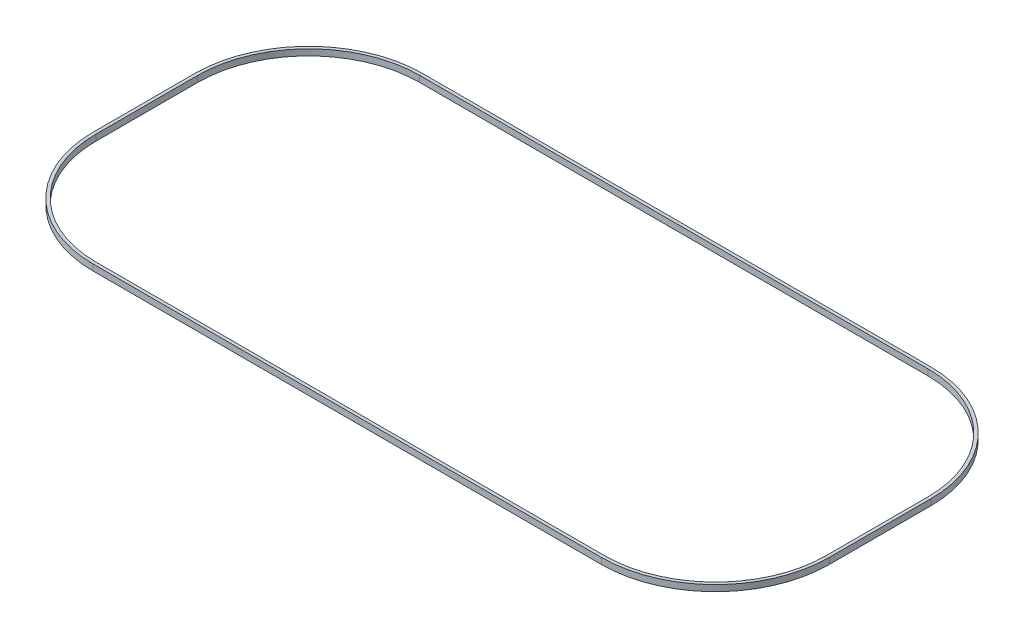
ISO-10303-21;
HEADER;
FILE_DESCRIPTION(('STEP AP214'),'2;1');
FILE_NAME('part.step','',(''),(''),'','','');
FILE_SCHEMA(('AUTOMOTIVE_DESIGN { 1 0 10303 214 1 1 1 1 }'));
ENDSEC;
DATA;
#1=APPLICATION_CONTEXT('core data for automotive mechanical design processes');
#2=APPLICATION_PROTOCOL_DEFINITION('international standard','automotive_design',2000,#1);
#3=PRODUCT_CONTEXT('',#1,'mechanical');
#4=PRODUCT('Part','Part','',(#3));
#5=PRODUCT_RELATED_PRODUCT_CATEGORY('part','',(#4));
#6=PRODUCT_DEFINITION_FORMATION('','',#4);
#7=PRODUCT_DEFINITION_CONTEXT('part definition',#1,'design');
#8=PRODUCT_DEFINITION('design','',#6,#7);
#9=PRODUCT_DEFINITION_SHAPE('','',#8);
#10=(LENGTH_UNIT() NAMED_UNIT(*) SI_UNIT(.MILLI.,.METRE.));
#11=(NAMED_UNIT(*) PLANE_ANGLE_UNIT() SI_UNIT($,.RADIAN.));
#12=(NAMED_UNIT(*) SI_UNIT($,.STERADIAN.) SOLID_ANGLE_UNIT());
#13=UNCERTAINTY_MEASURE_WITH_UNIT(LENGTH_MEASURE(1.E-05),#10,'distance_accuracy_value','');
#14=(GEOMETRIC_REPRESENTATION_CONTEXT(3) GLOBAL_UNCERTAINTY_ASSIGNED_CONTEXT((#13)) GLOBAL_UNIT_ASSIGNED_CONTEXT((#10,
#11,#12)) REPRESENTATION_CONTEXT('',''));
#15=CARTESIAN_POINT('',(0.,0.,0.));
#16=DIRECTION('',(0.,0.,1.));
#17=DIRECTION('',(1.,0.,0.));
#18=AXIS2_PLACEMENT_3D('',#15,#16,#17);
#19=CARTESIAN_POINT('',(0.,1.016,-21.3445877279403));
#20=DIRECTION('',(0.,1.,0.));
#21=DIRECTION('',(0.,0.,1.));
#22=AXIS2_PLACEMENT_3D('',#19,#20,#21);
#23=PLANE('',#22);
#24=DIRECTION('',(1.,0.,0.));
#25=VECTOR('',#24,1.);
#26=CARTESIAN_POINT('',(0.,1.016,-3.048));
#27=LINE('',#26,#25);
#28=CARTESIAN_POINT('',(0.,1.016,-3.048));
#29=VERTEX_POINT('',#28);
#30=CARTESIAN_POINT('',(83.82,1.016,-3.048));
#31=VERTEX_POINT('',#30);
#32=EDGE_CURVE('E195',#29,#31,#27,.T.);
#33=ORIENTED_EDGE('',*,*,#32,.F.);
#34=CARTESIAN_POINT('',(0.,1.016,-21.3445877279403));
#35=DIRECTION('',(0.,1.,0.));
#36=DIRECTION('',(0.,0.,1.));
#37=AXIS2_PLACEMENT_3D('',#34,#35,#36);
#38=CIRCLE('',#37,18.2965877279403);
#39=CARTESIAN_POINT('',(-18.2965877279402,1.016,-21.3445877279402));
#40=VERTEX_POINT('',#39);
#41=EDGE_CURVE('E193',#40,#29,#38,.T.);
#42=ORIENTED_EDGE('',*,*,#41,.F.);
#43=DIRECTION('',(0.,0.,1.));
#44=VECTOR('',#43,1.);
#45=CARTESIAN_POINT('',(-18.2965877279403,1.016,-38.1085877279403));
#46=LINE('',#45,#44);
#47=CARTESIAN_POINT('',(-18.2965877279403,1.016,-38.1085877279403));
#48=VERTEX_POINT('',#47);
#49=EDGE_CURVE('E209',#48,#40,#46,.T.);
#50=ORIENTED_EDGE('',*,*,#49,.F.);
#51=CARTESIAN_POINT('',(0.,1.016,-38.1085877279402));
#52=DIRECTION('',(0.,1.,0.));
#53=DIRECTION('',(0.,0.,1.));
#54=AXIS2_PLACEMENT_3D('',#51,#52,#53);
#55=CIRCLE('',#54,18.2965877279403);
#56=CARTESIAN_POINT('',(0.,1.016,-56.4051754558805));
#57=VERTEX_POINT('',#56);
#58=EDGE_CURVE('E206',#57,#48,#55,.T.);
#59=ORIENTED_EDGE('',*,*,#58,.F.);
#60=DIRECTION('',(-1.,0.,0.));
#61=VECTOR('',#60,1.);
#62=CARTESIAN_POINT('',(83.82,1.016,-56.4051754558805));
#63=LINE('',#62,#61);
#64=CARTESIAN_POINT('',(83.82,1.016,-56.4051754558806));
#65=VERTEX_POINT('',#64);
#66=EDGE_CURVE('E204',#65,#57,#63,.T.);
#67=ORIENTED_EDGE('',*,*,#66,.F.);
#68=CARTESIAN_POINT('',(83.82,1.016,-38.1085877279403));
#69=DIRECTION('',(0.,1.,0.));
#70=DIRECTION('',(0.,0.,1.));
#71=AXIS2_PLACEMENT_3D('',#68,#69,#70);
#72=CIRCLE('',#71,18.2965877279403);
#73=CARTESIAN_POINT('',(102.11658772794,1.016,-38.1085877279403));
#74=VERTEX_POINT('',#73);
#75=EDGE_CURVE('E202',#74,#65,#72,.T.);
#76=ORIENTED_EDGE('',*,*,#75,.F.);
#77=DIRECTION('',(0.,0.,-1.));
#78=VECTOR('',#77,1.);
#79=CARTESIAN_POINT('',(102.11658772794,1.016,-21.3445877279403));
#80=LINE('',#79,#78);
#81=CARTESIAN_POINT('',(102.11658772794,1.016,-21.3445877279403));
#82=VERTEX_POINT('',#81);
#83=EDGE_CURVE('E200',#82,#74,#80,.T.);
#84=ORIENTED_EDGE('',*,*,#83,.F.);
#85=CARTESIAN_POINT('',(83.82,1.016,-21.3445877279403));
#86=DIRECTION('',(0.,1.,0.));
#87=DIRECTION('',(0.,0.,1.));
#88=AXIS2_PLACEMENT_3D('',#85,#86,#87);
#89=CIRCLE('',#88,18.2965877279403);
#90=EDGE_CURVE('E198',#31,#82,#89,.T.);
#91=ORIENTED_EDGE('',*,*,#90,.F.);
#92=EDGE_LOOP('',(#33,#42,#50,#59,#67,#76,#84,#91));
#93=FACE_BOUND('',#92,.T.);
#94=DIRECTION('',(0.,0.,1.));
#95=VECTOR('',#94,1.);
#96=CARTESIAN_POINT('',(-18.8045877279402,1.016,-38.1085877279403));
#97=LINE('',#96,#95);
#98=CARTESIAN_POINT('',(-18.8045877279402,1.016,-38.1085877279403));
#99=VERTEX_POINT('',#98);
#100=CARTESIAN_POINT('',(-18.8045877279402,1.016,-21.3445877279402));
#101=VERTEX_POINT('',#100);
#102=EDGE_CURVE('E179',#99,#101,#97,.T.);
#103=ORIENTED_EDGE('',*,*,#102,.T.);
#104=CARTESIAN_POINT('',(0.,1.016,-21.3445877279403));
#105=DIRECTION('',(0.,1.,0.));
#106=DIRECTION('',(0.,0.,1.));
#107=AXIS2_PLACEMENT_3D('',#104,#105,#106);
#108=CIRCLE('',#107,18.8045877279402);
#109=CARTESIAN_POINT('',(0.,1.016,-2.54));
#110=VERTEX_POINT('',#109);
#111=EDGE_CURVE('E168',#101,#110,#108,.T.);
#112=ORIENTED_EDGE('',*,*,#111,.T.);
#113=DIRECTION('',(1.,0.,0.));
#114=VECTOR('',#113,1.);
#115=CARTESIAN_POINT('',(0.,1.016,-2.54));
#116=LINE('',#115,#114);
#117=CARTESIAN_POINT('',(83.82,1.016,-2.54));
#118=VERTEX_POINT('',#117);
#119=EDGE_CURVE('E166',#110,#118,#116,.T.);
#120=ORIENTED_EDGE('',*,*,#119,.T.);
#121=CARTESIAN_POINT('',(83.82,1.016,-21.3445877279403));
#122=DIRECTION('',(0.,1.,0.));
#123=DIRECTION('',(0.,0.,1.));
#124=AXIS2_PLACEMENT_3D('',#121,#122,#123);
#125=CIRCLE('',#124,18.8045877279403);
#126=CARTESIAN_POINT('',(102.62458772794,1.016,-21.3445877279403));
#127=VERTEX_POINT('',#126);
#128=EDGE_CURVE('E48',#118,#127,#125,.T.);
#129=ORIENTED_EDGE('',*,*,#128,.T.);
#130=DIRECTION('',(0.,0.,-1.));
#131=VECTOR('',#130,1.);
#132=CARTESIAN_POINT('',(102.62458772794,1.016,-21.3445877279403));
#133=LINE('',#132,#131);
#134=CARTESIAN_POINT('',(102.62458772794,1.016,-38.1085877279403));
#135=VERTEX_POINT('',#134);
#136=EDGE_CURVE('E155',#127,#135,#133,.T.);
#137=ORIENTED_EDGE('',*,*,#136,.T.);
#138=CARTESIAN_POINT('',(83.82,1.016,-38.1085877279403));
#139=DIRECTION('',(0.,1.,0.));
#140=DIRECTION('',(0.,0.,1.));
#141=AXIS2_PLACEMENT_3D('',#138,#139,#140);
#142=CIRCLE('',#141,18.8045877279403);
#143=CARTESIAN_POINT('',(83.82,1.016,-56.9131754558805));
#144=VERTEX_POINT('',#143);
#145=EDGE_CURVE('E161',#135,#144,#142,.T.);
#146=ORIENTED_EDGE('',*,*,#145,.T.);
#147=DIRECTION('',(-1.,0.,0.));
#148=VECTOR('',#147,1.);
#149=CARTESIAN_POINT('',(83.82,1.016,-56.9131754558805));
#150=LINE('',#149,#148);
#151=CARTESIAN_POINT('',(0.,1.016,-56.9131754558805));
#152=VERTEX_POINT('',#151);
#153=EDGE_CURVE('E173',#144,#152,#150,.T.);
#154=ORIENTED_EDGE('',*,*,#153,.T.);
#155=CARTESIAN_POINT('',(0.,1.016,-38.1085877279403));
#156=DIRECTION('',(0.,1.,0.));
#157=DIRECTION('',(0.,0.,1.));
#158=AXIS2_PLACEMENT_3D('',#155,#156,#157);
#159=CIRCLE('',#158,18.8045877279403);
#160=EDGE_CURVE('E176',#152,#99,#159,.T.);
#161=ORIENTED_EDGE('',*,*,#160,.T.);
#162=EDGE_LOOP('',(#103,#112,#120,#129,#137,#146,#154,#161));
#163=FACE_BOUND('',#162,.T.);
#164=ADVANCED_FACE('F33',(#93,#163),#23,.T.);
#165=CARTESIAN_POINT('',(0.,0.,-21.3445877279403));
#166=DIRECTION('',(0.,1.,0.));
#167=DIRECTION('',(0.,0.,1.));
#168=AXIS2_PLACEMENT_3D('',#165,#166,#167);
#169=PLANE('',#168);
#170=CARTESIAN_POINT('',(0.,0.,-21.3445877279403));
#171=DIRECTION('',(0.,1.,0.));
#172=DIRECTION('',(0.,0.,1.));
#173=AXIS2_PLACEMENT_3D('',#170,#171,#172);
#174=CIRCLE('',#173,18.2965877279403);
#175=CARTESIAN_POINT('',(-18.2965877279402,0.,-21.3445877279402));
#176=VERTEX_POINT('',#175);
#177=CARTESIAN_POINT('',(0.,0.,-3.048));
#178=VERTEX_POINT('',#177);
#179=EDGE_CURVE('E183',#176,#178,#174,.T.);
#180=ORIENTED_EDGE('',*,*,#179,.T.);
#181=DIRECTION('',(1.,0.,0.));
#182=VECTOR('',#181,1.);
#183=CARTESIAN_POINT('',(0.,0.,-3.048));
#184=LINE('',#183,#182);
#185=CARTESIAN_POINT('',(83.82,0.,-3.048));
#186=VERTEX_POINT('',#185);
#187=EDGE_CURVE('E214',#178,#186,#184,.T.);
#188=ORIENTED_EDGE('',*,*,#187,.T.);
#189=CARTESIAN_POINT('',(83.82,0.,-21.3445877279403));
#190=DIRECTION('',(0.,1.,0.));
#191=DIRECTION('',(0.,0.,1.));
#192=AXIS2_PLACEMENT_3D('',#189,#190,#191);
#193=CIRCLE('',#192,18.2965877279403);
#194=CARTESIAN_POINT('',(102.11658772794,0.,-21.3445877279403));
#195=VERTEX_POINT('',#194);
#196=EDGE_CURVE('E217',#186,#195,#193,.T.);
#197=ORIENTED_EDGE('',*,*,#196,.T.);
#198=DIRECTION('',(0.,0.,-1.));
#199=VECTOR('',#198,1.);
#200=CARTESIAN_POINT('',(102.11658772794,0.,-21.3445877279403));
#201=LINE('',#200,#199);
#202=CARTESIAN_POINT('',(102.11658772794,0.,-38.1085877279403));
#203=VERTEX_POINT('',#202);
#204=EDGE_CURVE('E220',#195,#203,#201,.T.);
#205=ORIENTED_EDGE('',*,*,#204,.T.);
#206=CARTESIAN_POINT('',(83.82,0.,-38.1085877279403));
#207=DIRECTION('',(0.,1.,0.));
#208=DIRECTION('',(0.,0.,1.));
#209=AXIS2_PLACEMENT_3D('',#206,#207,#208);
#210=CIRCLE('',#209,18.2965877279403);
#211=CARTESIAN_POINT('',(83.82,0.,-56.4051754558806));
#212=VERTEX_POINT('',#211);
#213=EDGE_CURVE('E223',#203,#212,#210,.T.);
#214=ORIENTED_EDGE('',*,*,#213,.T.);
#215=DIRECTION('',(-1.,0.,0.));
#216=VECTOR('',#215,1.);
#217=CARTESIAN_POINT('',(83.82,0.,-56.4051754558805));
#218=LINE('',#217,#216);
#219=CARTESIAN_POINT('',(0.,0.,-56.4051754558805));
#220=VERTEX_POINT('',#219);
#221=EDGE_CURVE('E226',#212,#220,#218,.T.);
#222=ORIENTED_EDGE('',*,*,#221,.T.);
#223=CARTESIAN_POINT('',(0.,0.,-38.1085877279402));
#224=DIRECTION('',(0.,1.,0.));
#225=DIRECTION('',(0.,0.,1.));
#226=AXIS2_PLACEMENT_3D('',#223,#224,#225);
#227=CIRCLE('',#226,18.2965877279403);
#228=CARTESIAN_POINT('',(-18.2965877279403,0.,-38.1085877279403));
#229=VERTEX_POINT('',#228);
#230=EDGE_CURVE('E229',#220,#229,#227,.T.);
#231=ORIENTED_EDGE('',*,*,#230,.T.);
#232=DIRECTION('',(0.,0.,1.));
#233=VECTOR('',#232,1.);
#234=CARTESIAN_POINT('',(-18.2965877279403,0.,-38.1085877279403));
#235=LINE('',#234,#233);
#236=EDGE_CURVE('E196',#229,#176,#235,.T.);
#237=ORIENTED_EDGE('',*,*,#236,.T.);
#238=EDGE_LOOP('',(#180,#188,#197,#205,#214,#222,#231,#237));
#239=FACE_BOUND('',#238,.T.);
#240=CARTESIAN_POINT('',(0.,0.,-21.3445877279403));
#241=DIRECTION('',(0.,1.,0.));
#242=DIRECTION('',(0.,0.,1.));
#243=AXIS2_PLACEMENT_3D('',#240,#241,#242);
#244=CIRCLE('',#243,18.8045877279402);
#245=CARTESIAN_POINT('',(-18.8045877279402,0.,-21.3445877279402));
#246=VERTEX_POINT('',#245);
#247=CARTESIAN_POINT('',(0.,0.,-2.54));
#248=VERTEX_POINT('',#247);
#249=EDGE_CURVE('E11',#246,#248,#244,.T.);
#250=ORIENTED_EDGE('',*,*,#249,.F.);
#251=DIRECTION('',(0.,0.,1.));
#252=VECTOR('',#251,1.);
#253=CARTESIAN_POINT('',(-18.8045877279402,0.,-21.3445877279402));
#254=LINE('',#253,#252);
#255=CARTESIAN_POINT('',(-18.8045877279402,0.,-38.1085877279403));
#256=VERTEX_POINT('',#255);
#257=EDGE_CURVE('E41',#256,#246,#254,.T.);
#258=ORIENTED_EDGE('',*,*,#257,.F.);
#259=CARTESIAN_POINT('',(0.,0.,-38.1085877279403));
#260=DIRECTION('',(0.,1.,0.));
#261=DIRECTION('',(0.,0.,1.));
#262=AXIS2_PLACEMENT_3D('',#259,#260,#261);
#263=CIRCLE('',#262,18.8045877279403);
#264=CARTESIAN_POINT('',(0.,0.,-56.9131754558805));
#265=VERTEX_POINT('',#264);
#266=EDGE_CURVE('E260',#265,#256,#263,.T.);
#267=ORIENTED_EDGE('',*,*,#266,.F.);
#268=DIRECTION('',(-1.,0.,0.));
#269=VECTOR('',#268,1.);
#270=CARTESIAN_POINT('',(0.,0.,-56.9131754558805));
#271=LINE('',#270,#269);
#272=CARTESIAN_POINT('',(83.82,0.,-56.9131754558805));
#273=VERTEX_POINT('',#272);
#274=EDGE_CURVE('E258',#273,#265,#271,.T.);
#275=ORIENTED_EDGE('',*,*,#274,.F.);
#276=CARTESIAN_POINT('',(83.82,0.,-38.1085877279403));
#277=DIRECTION('',(0.,1.,0.));
#278=DIRECTION('',(0.,0.,1.));
#279=AXIS2_PLACEMENT_3D('',#276,#277,#278);
#280=CIRCLE('',#279,18.8045877279403);
#281=CARTESIAN_POINT('',(102.62458772794,0.,-38.1085877279403));
#282=VERTEX_POINT('',#281);
#283=EDGE_CURVE('E256',#282,#273,#280,.T.);
#284=ORIENTED_EDGE('',*,*,#283,.F.);
#285=DIRECTION('',(0.,0.,-1.));
#286=VECTOR('',#285,1.);
#287=CARTESIAN_POINT('',(102.62458772794,0.,-21.3445877279403));
#288=LINE('',#287,#286);
#289=CARTESIAN_POINT('',(102.62458772794,0.,-21.3445877279403));
#290=VERTEX_POINT('',#289);
#291=EDGE_CURVE('E254',#290,#282,#288,.T.);
#292=ORIENTED_EDGE('',*,*,#291,.F.);
#293=CARTESIAN_POINT('',(83.82,0.,-21.3445877279403));
#294=DIRECTION('',(0.,1.,0.));
#295=DIRECTION('',(0.,0.,1.));
#296=AXIS2_PLACEMENT_3D('',#293,#294,#295);
#297=CIRCLE('',#296,18.8045877279403);
#298=CARTESIAN_POINT('',(83.82,0.,-2.54));
#299=VERTEX_POINT('',#298);
#300=EDGE_CURVE('E148',#299,#290,#297,.T.);
#301=ORIENTED_EDGE('',*,*,#300,.F.);
#302=DIRECTION('',(1.,0.,0.));
#303=VECTOR('',#302,1.);
#304=CARTESIAN_POINT('',(0.,0.,-2.54));
#305=LINE('',#304,#303);
#306=EDGE_CURVE('E251',#248,#299,#305,.T.);
#307=ORIENTED_EDGE('',*,*,#306,.F.);
#308=EDGE_LOOP('',(#250,#258,#267,#275,#284,#292,#301,#307));
#309=FACE_BOUND('',#308,.T.);
#310=ADVANCED_FACE('F35',(#239,#309),#169,.F.);
#311=CARTESIAN_POINT('',(0.,1.016,-21.3445877279403));
#312=DIRECTION('',(0.,-1.,0.));
#313=DIRECTION('',(0.,0.,-1.));
#314=AXIS2_PLACEMENT_3D('',#311,#312,#313);
#315=CYLINDRICAL_SURFACE('',#314,18.2965877279403);
#316=ORIENTED_EDGE('',*,*,#179,.F.);
#317=DIRECTION('',(0.,-1.,0.));
#318=VECTOR('',#317,1.);
#319=CARTESIAN_POINT('',(-18.2965877279402,1.016,-21.3445877279402));
#320=LINE('',#319,#318);
#321=EDGE_CURVE('E211',#40,#176,#320,.T.);
#322=ORIENTED_EDGE('',*,*,#321,.F.);
#323=ORIENTED_EDGE('',*,*,#41,.T.);
#324=DIRECTION('',(0.,-1.,0.));
#325=VECTOR('',#324,1.);
#326=CARTESIAN_POINT('',(0.,1.016,-3.048));
#327=LINE('',#326,#325);
#328=EDGE_CURVE('E248',#29,#178,#327,.T.);
#329=ORIENTED_EDGE('',*,*,#328,.T.);
#330=EDGE_LOOP('',(#316,#322,#323,#329));
#331=FACE_BOUND('',#330,.T.);
#332=ADVANCED_FACE('F300',(#331),#315,.F.);
#333=CARTESIAN_POINT('',(0.,1.016,-3.048));
#334=DIRECTION('',(0.,0.,-1.));
#335=DIRECTION('',(-1.,0.,0.));
#336=AXIS2_PLACEMENT_3D('',#333,#334,#335);
#337=PLANE('',#336);
#338=ORIENTED_EDGE('',*,*,#187,.F.);
#339=ORIENTED_EDGE('',*,*,#328,.F.);
#340=ORIENTED_EDGE('',*,*,#32,.T.);
#341=DIRECTION('',(0.,-1.,0.));
#342=VECTOR('',#341,1.);
#343=CARTESIAN_POINT('',(83.82,1.016,-3.048));
#344=LINE('',#343,#342);
#345=EDGE_CURVE('E246',#31,#186,#344,.T.);
#346=ORIENTED_EDGE('',*,*,#345,.T.);
#347=EDGE_LOOP('',(#338,#339,#340,#346));
#348=FACE_BOUND('',#347,.T.);
#349=ADVANCED_FACE('F306',(#348),#337,.T.);
#350=CARTESIAN_POINT('',(83.82,1.016,-21.3445877279403));
#351=DIRECTION('',(0.,-1.,0.));
#352=DIRECTION('',(0.,0.,-1.));
#353=AXIS2_PLACEMENT_3D('',#350,#351,#352);
#354=CYLINDRICAL_SURFACE('',#353,18.2965877279403);
#355=ORIENTED_EDGE('',*,*,#196,.F.);
#356=ORIENTED_EDGE('',*,*,#345,.F.);
#357=ORIENTED_EDGE('',*,*,#90,.T.);
#358=DIRECTION('',(0.,-1.,0.));
#359=VECTOR('',#358,1.);
#360=CARTESIAN_POINT('',(102.11658772794,1.016,-21.3445877279403));
#361=LINE('',#360,#359);
#362=EDGE_CURVE('E244',#82,#195,#361,.T.);
#363=ORIENTED_EDGE('',*,*,#362,.T.);
#364=EDGE_LOOP('',(#355,#356,#357,#363));
#365=FACE_BOUND('',#364,.T.);
#366=ADVANCED_FACE('F310',(#365),#354,.F.);
#367=CARTESIAN_POINT('',(102.11658772794,1.016,-21.3445877279403));
#368=DIRECTION('',(-1.,0.,0.));
#369=DIRECTION('',(0.,0.,1.));
#370=AXIS2_PLACEMENT_3D('',#367,#368,#369);
#371=PLANE('',#370);
#372=ORIENTED_EDGE('',*,*,#204,.F.);
#373=ORIENTED_EDGE('',*,*,#362,.F.);
#374=ORIENTED_EDGE('',*,*,#83,.T.);
#375=DIRECTION('',(0.,-1.,0.));
#376=VECTOR('',#375,1.);
#377=CARTESIAN_POINT('',(102.11658772794,1.016,-38.1085877279403));
#378=LINE('',#377,#376);
#379=EDGE_CURVE('E242',#74,#203,#378,.T.);
#380=ORIENTED_EDGE('',*,*,#379,.T.);
#381=EDGE_LOOP('',(#372,#373,#374,#380));
#382=FACE_BOUND('',#381,.T.);
#383=ADVANCED_FACE('F314',(#382),#371,.T.);
#384=CARTESIAN_POINT('',(83.82,1.016,-38.1085877279403));
#385=DIRECTION('',(0.,-1.,0.));
#386=DIRECTION('',(0.,0.,-1.));
#387=AXIS2_PLACEMENT_3D('',#384,#385,#386);
#388=CYLINDRICAL_SURFACE('',#387,18.2965877279403);
#389=ORIENTED_EDGE('',*,*,#213,.F.);
#390=ORIENTED_EDGE('',*,*,#379,.F.);
#391=ORIENTED_EDGE('',*,*,#75,.T.);
#392=DIRECTION('',(0.,-1.,0.));
#393=VECTOR('',#392,1.);
#394=CARTESIAN_POINT('',(83.82,1.016,-56.4051754558806));
#395=LINE('',#394,#393);
#396=EDGE_CURVE('E240',#65,#212,#395,.T.);
#397=ORIENTED_EDGE('',*,*,#396,.T.);
#398=EDGE_LOOP('',(#389,#390,#391,#397));
#399=FACE_BOUND('',#398,.T.);
#400=ADVANCED_FACE('F318',(#399),#388,.F.);
#401=CARTESIAN_POINT('',(83.82,1.016,-56.4051754558805));
#402=DIRECTION('',(0.,0.,1.));
#403=DIRECTION('',(1.,0.,0.));
#404=AXIS2_PLACEMENT_3D('',#401,#402,#403);
#405=PLANE('',#404);
#406=ORIENTED_EDGE('',*,*,#221,.F.);
#407=ORIENTED_EDGE('',*,*,#396,.F.);
#408=ORIENTED_EDGE('',*,*,#66,.T.);
#409=DIRECTION('',(0.,-1.,0.));
#410=VECTOR('',#409,1.);
#411=CARTESIAN_POINT('',(0.,1.016,-56.4051754558805));
#412=LINE('',#411,#410);
#413=EDGE_CURVE('E238',#57,#220,#412,.T.);
#414=ORIENTED_EDGE('',*,*,#413,.T.);
#415=EDGE_LOOP('',(#406,#407,#408,#414));
#416=FACE_BOUND('',#415,.T.);
#417=ADVANCED_FACE('F322',(#416),#405,.T.);
#418=CARTESIAN_POINT('',(0.,1.016,-38.1085877279402));
#419=DIRECTION('',(0.,-1.,0.));
#420=DIRECTION('',(0.,0.,-1.));
#421=AXIS2_PLACEMENT_3D('',#418,#419,#420);
#422=CYLINDRICAL_SURFACE('',#421,18.2965877279403);
#423=ORIENTED_EDGE('',*,*,#230,.F.);
#424=ORIENTED_EDGE('',*,*,#413,.F.);
#425=ORIENTED_EDGE('',*,*,#58,.T.);
#426=DIRECTION('',(0.,-1.,0.));
#427=VECTOR('',#426,1.);
#428=CARTESIAN_POINT('',(-18.2965877279403,1.016,-38.1085877279403));
#429=LINE('',#428,#427);
#430=EDGE_CURVE('E236',#48,#229,#429,.T.);
#431=ORIENTED_EDGE('',*,*,#430,.T.);
#432=EDGE_LOOP('',(#423,#424,#425,#431));
#433=FACE_BOUND('',#432,.T.);
#434=ADVANCED_FACE('F326',(#433),#422,.F.);
#435=CARTESIAN_POINT('',(-18.2965877279403,1.016,-38.1085877279403));
#436=DIRECTION('',(1.,0.,0.));
#437=DIRECTION('',(0.,0.,-1.));
#438=AXIS2_PLACEMENT_3D('',#435,#436,#437);
#439=PLANE('',#438);
#440=ORIENTED_EDGE('',*,*,#236,.F.);
#441=ORIENTED_EDGE('',*,*,#430,.F.);
#442=ORIENTED_EDGE('',*,*,#49,.T.);
#443=ORIENTED_EDGE('',*,*,#321,.T.);
#444=EDGE_LOOP('',(#440,#441,#442,#443));
#445=FACE_BOUND('',#444,.T.);
#446=ADVANCED_FACE('F330',(#445),#439,.T.);
#447=CARTESIAN_POINT('',(0.,-1.524,-21.3445877279403));
#448=DIRECTION('',(0.,1.,0.));
#449=DIRECTION('',(0.,0.,1.));
#450=AXIS2_PLACEMENT_3D('',#447,#448,#449);
#451=CYLINDRICAL_SURFACE('',#450,18.8045877279402);
#452=ORIENTED_EDGE('',*,*,#249,.T.);
#453=DIRECTION('',(0.,1.,0.));
#454=VECTOR('',#453,1.);
#455=CARTESIAN_POINT('',(0.,-1.524,-2.54));
#456=LINE('',#455,#454);
#457=EDGE_CURVE('E56',#248,#110,#456,.T.);
#458=ORIENTED_EDGE('',*,*,#457,.T.);
#459=ORIENTED_EDGE('',*,*,#111,.F.);
#460=DIRECTION('',(0.,1.,0.));
#461=VECTOR('',#460,1.);
#462=CARTESIAN_POINT('',(-18.8045877279402,-1.524,-21.3445877279402));
#463=LINE('',#462,#461);
#464=EDGE_CURVE('E181',#246,#101,#463,.T.);
#465=ORIENTED_EDGE('',*,*,#464,.F.);
#466=EDGE_LOOP('',(#452,#458,#459,#465));
#467=FACE_BOUND('',#466,.T.);
#468=ADVANCED_FACE('F272',(#467),#451,.T.);
#469=CARTESIAN_POINT('',(-18.8045877279402,-1.524,-38.1085877279403));
#470=DIRECTION('',(-1.,0.,0.));
#471=DIRECTION('',(0.,0.,1.));
#472=AXIS2_PLACEMENT_3D('',#469,#470,#471);
#473=PLANE('',#472);
#474=ORIENTED_EDGE('',*,*,#257,.T.);
#475=ORIENTED_EDGE('',*,*,#464,.T.);
#476=ORIENTED_EDGE('',*,*,#102,.F.);
#477=DIRECTION('',(0.,1.,0.));
#478=VECTOR('',#477,1.);
#479=CARTESIAN_POINT('',(-18.8045877279402,-1.524,-38.1085877279403));
#480=LINE('',#479,#478);
#481=EDGE_CURVE('E184',#256,#99,#480,.T.);
#482=ORIENTED_EDGE('',*,*,#481,.F.);
#483=EDGE_LOOP('',(#474,#475,#476,#482));
#484=FACE_BOUND('',#483,.T.);
#485=ADVANCED_FACE('F265',(#484),#473,.T.);
#486=CARTESIAN_POINT('',(0.,-1.524,-38.1085877279403));
#487=DIRECTION('',(0.,1.,0.));
#488=DIRECTION('',(0.,0.,1.));
#489=AXIS2_PLACEMENT_3D('',#486,#487,#488);
#490=CYLINDRICAL_SURFACE('',#489,18.8045877279403);
#491=ORIENTED_EDGE('',*,*,#266,.T.);
#492=ORIENTED_EDGE('',*,*,#481,.T.);
#493=ORIENTED_EDGE('',*,*,#160,.F.);
#494=DIRECTION('',(0.,1.,0.));
#495=VECTOR('',#494,1.);
#496=CARTESIAN_POINT('',(0.,-1.524,-56.9131754558805));
#497=LINE('',#496,#495);
#498=EDGE_CURVE('E186',#265,#152,#497,.T.);
#499=ORIENTED_EDGE('',*,*,#498,.F.);
#500=EDGE_LOOP('',(#491,#492,#493,#499));
#501=FACE_BOUND('',#500,.T.);
#502=ADVANCED_FACE('F279',(#501),#490,.T.);
#503=CARTESIAN_POINT('',(83.82,-1.524,-56.9131754558805));
#504=DIRECTION('',(0.,0.,-1.));
#505=DIRECTION('',(-1.,0.,0.));
#506=AXIS2_PLACEMENT_3D('',#503,#504,#505);
#507=PLANE('',#506);
#508=ORIENTED_EDGE('',*,*,#274,.T.);
#509=ORIENTED_EDGE('',*,*,#498,.T.);
#510=ORIENTED_EDGE('',*,*,#153,.F.);
#511=DIRECTION('',(0.,1.,0.));
#512=VECTOR('',#511,1.);
#513=CARTESIAN_POINT('',(83.82,-1.524,-56.9131754558805));
#514=LINE('',#513,#512);
#515=EDGE_CURVE('E188',#273,#144,#514,.T.);
#516=ORIENTED_EDGE('',*,*,#515,.F.);
#517=EDGE_LOOP('',(#508,#509,#510,#516));
#518=FACE_BOUND('',#517,.T.);
#519=ADVANCED_FACE('F284',(#518),#507,.T.);
#520=CARTESIAN_POINT('',(83.82,-1.524,-38.1085877279403));
#521=DIRECTION('',(0.,1.,0.));
#522=DIRECTION('',(0.,0.,1.));
#523=AXIS2_PLACEMENT_3D('',#520,#521,#522);
#524=CYLINDRICAL_SURFACE('',#523,18.8045877279403);
#525=ORIENTED_EDGE('',*,*,#283,.T.);
#526=ORIENTED_EDGE('',*,*,#515,.T.);
#527=ORIENTED_EDGE('',*,*,#145,.F.);
#528=DIRECTION('',(0.,1.,0.));
#529=VECTOR('',#528,1.);
#530=CARTESIAN_POINT('',(102.62458772794,-1.524,-38.1085877279403));
#531=LINE('',#530,#529);
#532=EDGE_CURVE('E151',#282,#135,#531,.T.);
#533=ORIENTED_EDGE('',*,*,#532,.F.);
#534=EDGE_LOOP('',(#525,#526,#527,#533));
#535=FACE_BOUND('',#534,.T.);
#536=ADVANCED_FACE('F286',(#535),#524,.T.);
#537=CARTESIAN_POINT('',(102.62458772794,-1.524,-21.3445877279403));
#538=DIRECTION('',(1.,0.,0.));
#539=DIRECTION('',(0.,0.,-1.));
#540=AXIS2_PLACEMENT_3D('',#537,#538,#539);
#541=PLANE('',#540);
#542=ORIENTED_EDGE('',*,*,#291,.T.);
#543=ORIENTED_EDGE('',*,*,#532,.T.);
#544=ORIENTED_EDGE('',*,*,#136,.F.);
#545=DIRECTION('',(0.,1.,0.));
#546=VECTOR('',#545,1.);
#547=CARTESIAN_POINT('',(102.62458772794,-1.524,-21.3445877279403));
#548=LINE('',#547,#546);
#549=EDGE_CURVE('E144',#290,#127,#548,.T.);
#550=ORIENTED_EDGE('',*,*,#549,.F.);
#551=EDGE_LOOP('',(#542,#543,#544,#550));
#552=FACE_BOUND('',#551,.T.);
#553=ADVANCED_FACE('F156',(#552),#541,.T.);
#554=CARTESIAN_POINT('',(83.82,-1.524,-21.3445877279403));
#555=DIRECTION('',(0.,1.,0.));
#556=DIRECTION('',(0.,0.,1.));
#557=AXIS2_PLACEMENT_3D('',#554,#555,#556);
#558=CYLINDRICAL_SURFACE('',#557,18.8045877279403);
#559=ORIENTED_EDGE('',*,*,#300,.T.);
#560=ORIENTED_EDGE('',*,*,#549,.T.);
#561=ORIENTED_EDGE('',*,*,#128,.F.);
#562=DIRECTION('',(0.,1.,0.));
#563=VECTOR('',#562,1.);
#564=CARTESIAN_POINT('',(83.82,-1.524,-2.54));
#565=LINE('',#564,#563);
#566=EDGE_CURVE('E152',#299,#118,#565,.T.);
#567=ORIENTED_EDGE('',*,*,#566,.F.);
#568=EDGE_LOOP('',(#559,#560,#561,#567));
#569=FACE_BOUND('',#568,.T.);
#570=ADVANCED_FACE('F146',(#569),#558,.T.);
#571=CARTESIAN_POINT('',(0.,-1.524,-2.54));
#572=DIRECTION('',(0.,0.,1.));
#573=DIRECTION('',(1.,0.,0.));
#574=AXIS2_PLACEMENT_3D('',#571,#572,#573);
#575=PLANE('',#574);
#576=ORIENTED_EDGE('',*,*,#306,.T.);
#577=ORIENTED_EDGE('',*,*,#566,.T.);
#578=ORIENTED_EDGE('',*,*,#119,.F.);
#579=ORIENTED_EDGE('',*,*,#457,.F.);
#580=EDGE_LOOP('',(#576,#577,#578,#579));
#581=FACE_BOUND('',#580,.T.);
#582=ADVANCED_FACE('F274',(#581),#575,.T.);
#583=CLOSED_SHELL('',(#164,#310,#332,#349,#366,#383,#400,#417,#434,#446,#468,#485,#502,#519,
#536,#553,#570,#582));
#584=MANIFOLD_SOLID_BREP('B2',#583);
#585=ADVANCED_BREP_SHAPE_REPRESENTATION('',(#18,#584),#14);
#586=SHAPE_DEFINITION_REPRESENTATION(#9,#585);
ENDSEC;
END-ISO-10303-21;
